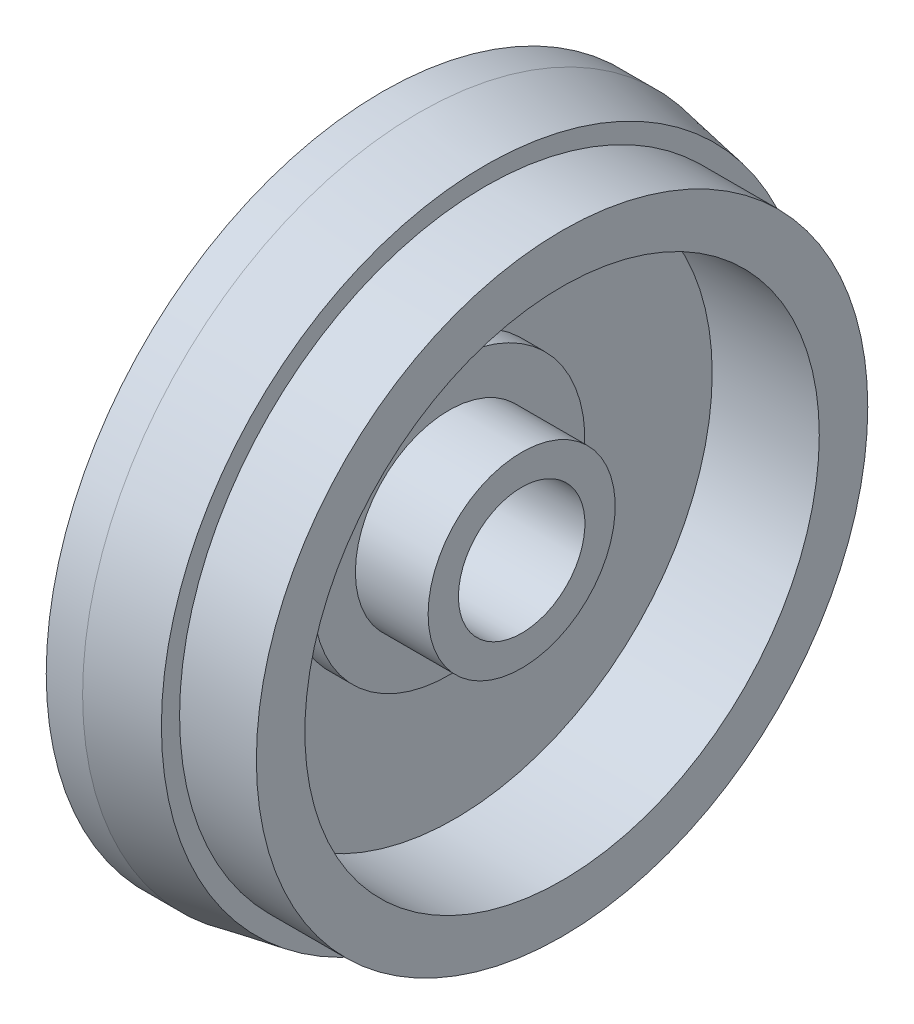
ISO-10303-21;
HEADER;
FILE_DESCRIPTION(('STEP AP214'),'2;1');
FILE_NAME('part.step','',(''),(''),'','','');
FILE_SCHEMA(('AUTOMOTIVE_DESIGN { 1 0 10303 214 1 1 1 1 }'));
ENDSEC;
DATA;
#1=APPLICATION_CONTEXT('core data for automotive mechanical design processes');
#2=APPLICATION_PROTOCOL_DEFINITION('international standard','automotive_design',2000,#1);
#3=PRODUCT_CONTEXT('',#1,'mechanical');
#4=PRODUCT('Part','Part','',(#3));
#5=PRODUCT_RELATED_PRODUCT_CATEGORY('part','',(#4));
#6=PRODUCT_DEFINITION_FORMATION('','',#4);
#7=PRODUCT_DEFINITION_CONTEXT('part definition',#1,'design');
#8=PRODUCT_DEFINITION('design','',#6,#7);
#9=PRODUCT_DEFINITION_SHAPE('','',#8);
#10=(LENGTH_UNIT() NAMED_UNIT(*) SI_UNIT(.MILLI.,.METRE.));
#11=(NAMED_UNIT(*) PLANE_ANGLE_UNIT() SI_UNIT($,.RADIAN.));
#12=(NAMED_UNIT(*) SI_UNIT($,.STERADIAN.) SOLID_ANGLE_UNIT());
#13=UNCERTAINTY_MEASURE_WITH_UNIT(LENGTH_MEASURE(1.E-05),#10,'distance_accuracy_value','');
#14=(GEOMETRIC_REPRESENTATION_CONTEXT(3) GLOBAL_UNCERTAINTY_ASSIGNED_CONTEXT((#13)) GLOBAL_UNIT_ASSIGNED_CONTEXT((#10,
#11,#12)) REPRESENTATION_CONTEXT('',''));
#15=CARTESIAN_POINT('',(0.,0.,0.));
#16=DIRECTION('',(0.,0.,1.));
#17=DIRECTION('',(1.,0.,0.));
#18=AXIS2_PLACEMENT_3D('',#15,#16,#17);
#19=CARTESIAN_POINT('',(535.225183996548,157.5,0.));
#20=DIRECTION('',(-1.,0.,0.));
#21=DIRECTION('',(0.,0.,1.));
#22=AXIS2_PLACEMENT_3D('',#19,#20,#21);
#23=CYLINDRICAL_SURFACE('',#22,22.432228314565);
#24=CARTESIAN_POINT('',(537.225183996548,157.5,0.));
#25=DIRECTION('',(-1.,0.,0.));
#26=DIRECTION('',(0.,0.,1.));
#27=AXIS2_PLACEMENT_3D('',#24,#25,#26);
#28=CIRCLE('',#27,22.432228314565);
#29=CARTESIAN_POINT('',(537.225183996548,157.5,22.432228314565));
#30=VERTEX_POINT('',#29);
#31=EDGE_CURVE('E18',#30,#30,#28,.T.);
#32=ORIENTED_EDGE('',*,*,#31,.T.);
#33=EDGE_LOOP('',(#32));
#34=FACE_BOUND('',#33,.T.);
#35=CARTESIAN_POINT('',(533.225183996548,157.5,0.));
#36=DIRECTION('',(-1.,0.,0.));
#37=DIRECTION('',(0.,0.,1.));
#38=AXIS2_PLACEMENT_3D('',#35,#36,#37);
#39=CIRCLE('',#38,22.432228314565);
#40=CARTESIAN_POINT('',(533.225183996548,157.5,22.432228314565));
#41=VERTEX_POINT('',#40);
#42=EDGE_CURVE('E78',#41,#41,#39,.F.);
#43=ORIENTED_EDGE('',*,*,#42,.T.);
#44=EDGE_LOOP('',(#43));
#45=FACE_BOUND('',#44,.T.);
#46=ADVANCED_FACE('F15',(#34,#45),#23,.T.);
#47=CARTESIAN_POINT('',(537.225183996548,176.432228314565,0.));
#48=DIRECTION('',(-1.,0.,0.));
#49=DIRECTION('',(0.,0.,1.));
#50=AXIS2_PLACEMENT_3D('',#47,#48,#49);
#51=PLANE('',#50);
#52=CARTESIAN_POINT('',(537.225183996548,157.5,0.));
#53=DIRECTION('',(-1.,0.,0.));
#54=DIRECTION('',(0.,0.,1.));
#55=AXIS2_PLACEMENT_3D('',#52,#53,#54);
#56=CIRCLE('',#55,15.432228314565);
#57=CARTESIAN_POINT('',(537.225183996548,157.5,15.432228314565));
#58=VERTEX_POINT('',#57);
#59=EDGE_CURVE('E76',#58,#58,#56,.F.);
#60=ORIENTED_EDGE('',*,*,#59,.F.);
#61=EDGE_LOOP('',(#60));
#62=FACE_BOUND('',#61,.T.);
#63=ORIENTED_EDGE('',*,*,#31,.F.);
#64=EDGE_LOOP('',(#63));
#65=FACE_BOUND('',#64,.T.);
#66=ADVANCED_FACE('F86',(#62,#65),#51,.F.);
#67=CARTESIAN_POINT('',(533.225183996548,193.932228314565,0.));
#68=DIRECTION('',(-1.,0.,0.));
#69=DIRECTION('',(0.,0.,1.));
#70=AXIS2_PLACEMENT_3D('',#67,#68,#69);
#71=PLANE('',#70);
#72=ORIENTED_EDGE('',*,*,#42,.F.);
#73=EDGE_LOOP('',(#72));
#74=FACE_BOUND('',#73,.T.);
#75=CARTESIAN_POINT('',(533.225183996548,157.5,0.));
#76=DIRECTION('',(-1.,0.,0.));
#77=DIRECTION('',(0.,0.,1.));
#78=AXIS2_PLACEMENT_3D('',#75,#76,#77);
#79=CIRCLE('',#78,50.432228314565);
#80=CARTESIAN_POINT('',(533.225183996548,157.5,50.432228314565));
#81=VERTEX_POINT('',#80);
#82=EDGE_CURVE('E73',#81,#81,#79,.F.);
#83=ORIENTED_EDGE('',*,*,#82,.T.);
#84=EDGE_LOOP('',(#83));
#85=FACE_BOUND('',#84,.T.);
#86=ADVANCED_FACE('F88',(#74,#85),#71,.F.);
#87=CARTESIAN_POINT('',(543.225183996548,157.5,0.));
#88=DIRECTION('',(-1.,0.,0.));
#89=DIRECTION('',(0.,0.,1.));
#90=AXIS2_PLACEMENT_3D('',#87,#88,#89);
#91=CYLINDRICAL_SURFACE('',#90,15.432228314565);
#92=CARTESIAN_POINT('',(549.225183996548,157.5,0.));
#93=DIRECTION('',(-1.,0.,0.));
#94=DIRECTION('',(0.,0.,1.));
#95=AXIS2_PLACEMENT_3D('',#92,#93,#94);
#96=CIRCLE('',#95,15.432228314565);
#97=CARTESIAN_POINT('',(549.225183996548,157.5,15.432228314565));
#98=VERTEX_POINT('',#97);
#99=EDGE_CURVE('E70',#98,#98,#96,.T.);
#100=ORIENTED_EDGE('',*,*,#99,.T.);
#101=EDGE_LOOP('',(#100));
#102=FACE_BOUND('',#101,.T.);
#103=ORIENTED_EDGE('',*,*,#59,.T.);
#104=EDGE_LOOP('',(#103));
#105=FACE_BOUND('',#104,.T.);
#106=ADVANCED_FACE('F95',(#102,#105),#91,.T.);
#107=CARTESIAN_POINT('',(535.725183996548,157.5,0.));
#108=DIRECTION('',(-1.,0.,0.));
#109=DIRECTION('',(0.,0.,1.));
#110=AXIS2_PLACEMENT_3D('',#107,#108,#109);
#111=CYLINDRICAL_SURFACE('',#110,50.432228314565);
#112=ORIENTED_EDGE('',*,*,#82,.F.);
#113=EDGE_LOOP('',(#112));
#114=FACE_BOUND('',#113,.T.);
#115=CARTESIAN_POINT('',(538.225183996548,157.5,0.));
#116=DIRECTION('',(-1.,0.,0.));
#117=DIRECTION('',(0.,0.,1.));
#118=AXIS2_PLACEMENT_3D('',#115,#116,#117);
#119=CIRCLE('',#118,50.432228314565);
#120=CARTESIAN_POINT('',(538.225183996548,157.5,50.432228314565));
#121=VERTEX_POINT('',#120);
#122=EDGE_CURVE('E67',#121,#121,#119,.F.);
#123=ORIENTED_EDGE('',*,*,#122,.T.);
#124=EDGE_LOOP('',(#123));
#125=FACE_BOUND('',#124,.T.);
#126=ADVANCED_FACE('F165',(#114,#125),#111,.F.);
#127=CARTESIAN_POINT('',(549.225183996548,170.432228314565,0.));
#128=DIRECTION('',(-1.,0.,0.));
#129=DIRECTION('',(0.,0.,1.));
#130=AXIS2_PLACEMENT_3D('',#127,#128,#129);
#131=PLANE('',#130);
#132=CARTESIAN_POINT('',(549.225183996548,157.5,0.));
#133=DIRECTION('',(-1.,0.,0.));
#134=DIRECTION('',(0.,0.,1.));
#135=AXIS2_PLACEMENT_3D('',#132,#133,#134);
#136=CIRCLE('',#135,10.432228314565);
#137=CARTESIAN_POINT('',(549.225183996548,157.5,10.432228314565));
#138=VERTEX_POINT('',#137);
#139=EDGE_CURVE('E64',#138,#138,#136,.T.);
#140=ORIENTED_EDGE('',*,*,#139,.T.);
#141=EDGE_LOOP('',(#140));
#142=FACE_BOUND('',#141,.T.);
#143=ORIENTED_EDGE('',*,*,#99,.F.);
#144=EDGE_LOOP('',(#143));
#145=FACE_BOUND('',#144,.T.);
#146=ADVANCED_FACE('F161',(#142,#145),#131,.F.);
#147=CARTESIAN_POINT('',(538.225183996548,203.932823212759,0.));
#148=DIRECTION('',(1.,0.,0.));
#149=DIRECTION('',(0.,0.,-1.));
#150=AXIS2_PLACEMENT_3D('',#147,#148,#149);
#151=PLANE('',#150);
#152=ORIENTED_EDGE('',*,*,#122,.F.);
#153=EDGE_LOOP('',(#152));
#154=FACE_BOUND('',#153,.T.);
#155=CARTESIAN_POINT('',(538.225183996548,157.5,0.));
#156=DIRECTION('',(1.,0.,0.));
#157=DIRECTION('',(0.,0.,-1.));
#158=AXIS2_PLACEMENT_3D('',#155,#156,#157);
#159=CIRCLE('',#158,42.433418110953);
#160=CARTESIAN_POINT('',(538.225183996548,157.5,-42.433418110953));
#161=VERTEX_POINT('',#160);
#162=EDGE_CURVE('E61',#161,#161,#159,.T.);
#163=ORIENTED_EDGE('',*,*,#162,.T.);
#164=EDGE_LOOP('',(#163));
#165=FACE_BOUND('',#164,.T.);
#166=ADVANCED_FACE('F157',(#154,#165),#151,.F.);
#167=CARTESIAN_POINT('',(541.725183996548,157.5,0.));
#168=DIRECTION('',(-1.,0.,0.));
#169=DIRECTION('',(0.,0.,1.));
#170=AXIS2_PLACEMENT_3D('',#167,#168,#169);
#171=CYLINDRICAL_SURFACE('',#170,10.432228314565);
#172=CARTESIAN_POINT('',(534.225183996548,157.5,0.));
#173=DIRECTION('',(-1.,0.,0.));
#174=DIRECTION('',(0.,0.,1.));
#175=AXIS2_PLACEMENT_3D('',#172,#173,#174);
#176=CIRCLE('',#175,10.432228314565);
#177=CARTESIAN_POINT('',(534.225183996548,157.5,10.432228314565));
#178=VERTEX_POINT('',#177);
#179=EDGE_CURVE('E58',#178,#178,#176,.T.);
#180=ORIENTED_EDGE('',*,*,#179,.T.);
#181=EDGE_LOOP('',(#180));
#182=FACE_BOUND('',#181,.T.);
#183=ORIENTED_EDGE('',*,*,#139,.F.);
#184=EDGE_LOOP('',(#183));
#185=FACE_BOUND('',#184,.T.);
#186=ADVANCED_FACE('F153',(#182,#185),#171,.F.);
#187=CARTESIAN_POINT('',(547.058284718157,157.5,0.));
#188=DIRECTION('',(1.,0.,0.));
#189=DIRECTION('',(0.,0.,-1.));
#190=AXIS2_PLACEMENT_3D('',#187,#188,#189);
#191=CYLINDRICAL_SURFACE('',#190,42.433418110953);
#192=ORIENTED_EDGE('',*,*,#162,.F.);
#193=EDGE_LOOP('',(#192));
#194=FACE_BOUND('',#193,.T.);
#195=CARTESIAN_POINT('',(555.891385439765,157.5,0.));
#196=DIRECTION('',(1.,0.,0.));
#197=DIRECTION('',(0.,0.,-1.));
#198=AXIS2_PLACEMENT_3D('',#195,#196,#197);
#199=CIRCLE('',#198,42.433418110953);
#200=CARTESIAN_POINT('',(555.891385439765,157.5,-42.433418110953));
#201=VERTEX_POINT('',#200);
#202=EDGE_CURVE('E55',#201,#201,#199,.F.);
#203=ORIENTED_EDGE('',*,*,#202,.F.);
#204=EDGE_LOOP('',(#203));
#205=FACE_BOUND('',#204,.T.);
#206=ADVANCED_FACE('F149',(#194,#205),#191,.F.);
#207=CARTESIAN_POINT('',(534.225183996548,164.432228314565,0.));
#208=DIRECTION('',(-1.,0.,0.));
#209=DIRECTION('',(0.,0.,1.));
#210=AXIS2_PLACEMENT_3D('',#207,#208,#209);
#211=PLANE('',#210);
#212=ORIENTED_EDGE('',*,*,#179,.F.);
#213=EDGE_LOOP('',(#212));
#214=FACE_BOUND('',#213,.T.);
#215=CARTESIAN_POINT('',(534.225183996548,157.5,0.));
#216=DIRECTION('',(-1.,0.,0.));
#217=DIRECTION('',(0.,0.,1.));
#218=AXIS2_PLACEMENT_3D('',#215,#216,#217);
#219=CIRCLE('',#218,3.43222831456501);
#220=CARTESIAN_POINT('',(534.225183996548,157.5,3.43222831456501));
#221=VERTEX_POINT('',#220);
#222=EDGE_CURVE('E52',#221,#221,#219,.T.);
#223=ORIENTED_EDGE('',*,*,#222,.T.);
#224=EDGE_LOOP('',(#223));
#225=FACE_BOUND('',#224,.T.);
#226=ADVANCED_FACE('F145',(#214,#225),#211,.F.);
#227=CARTESIAN_POINT('',(555.891385439765,203.932823212759,0.));
#228=DIRECTION('',(1.,0.,0.));
#229=DIRECTION('',(0.,0.,-1.));
#230=AXIS2_PLACEMENT_3D('',#227,#228,#229);
#231=PLANE('',#230);
#232=ORIENTED_EDGE('',*,*,#202,.T.);
#233=EDGE_LOOP('',(#232));
#234=FACE_BOUND('',#233,.T.);
#235=CARTESIAN_POINT('',(555.891385439765,157.5,0.));
#236=DIRECTION('',(1.,0.,0.));
#237=DIRECTION('',(0.,0.,-1.));
#238=AXIS2_PLACEMENT_3D('',#235,#236,#237);
#239=CIRCLE('',#238,50.432228314565);
#240=CARTESIAN_POINT('',(555.891385439765,157.5,-50.432228314565));
#241=VERTEX_POINT('',#240);
#242=EDGE_CURVE('E49',#241,#241,#239,.F.);
#243=ORIENTED_EDGE('',*,*,#242,.F.);
#244=EDGE_LOOP('',(#243));
#245=FACE_BOUND('',#244,.T.);
#246=ADVANCED_FACE('F141',(#234,#245),#231,.T.);
#247=CARTESIAN_POINT('',(529.225183996548,157.5,0.));
#248=DIRECTION('',(-1.,0.,0.));
#249=DIRECTION('',(0.,0.,1.));
#250=AXIS2_PLACEMENT_3D('',#247,#248,#249);
#251=CYLINDRICAL_SURFACE('',#250,3.43222831456501);
#252=CARTESIAN_POINT('',(526.225183996548,157.5,0.));
#253=DIRECTION('',(-1.,0.,0.));
#254=DIRECTION('',(0.,0.,1.));
#255=AXIS2_PLACEMENT_3D('',#252,#253,#254);
#256=CIRCLE('',#255,3.43222831456501);
#257=CARTESIAN_POINT('',(526.225183996548,157.5,3.43222831456501));
#258=VERTEX_POINT('',#257);
#259=EDGE_CURVE('E46',#258,#258,#256,.F.);
#260=ORIENTED_EDGE('',*,*,#259,.F.);
#261=EDGE_LOOP('',(#260));
#262=FACE_BOUND('',#261,.T.);
#263=ORIENTED_EDGE('',*,*,#222,.F.);
#264=EDGE_LOOP('',(#263));
#265=FACE_BOUND('',#264,.T.);
#266=ADVANCED_FACE('F137',(#262,#265),#251,.F.);
#267=CARTESIAN_POINT('',(549.558284718157,157.5,0.));
#268=DIRECTION('',(1.,0.,0.));
#269=DIRECTION('',(0.,0.,-1.));
#270=AXIS2_PLACEMENT_3D('',#267,#268,#269);
#271=CYLINDRICAL_SURFACE('',#270,50.432228314565);
#272=ORIENTED_EDGE('',*,*,#242,.T.);
#273=EDGE_LOOP('',(#272));
#274=FACE_BOUND('',#273,.T.);
#275=CARTESIAN_POINT('',(543.225183996548,157.5,0.));
#276=DIRECTION('',(1.,0.,0.));
#277=DIRECTION('',(0.,0.,-1.));
#278=AXIS2_PLACEMENT_3D('',#275,#276,#277);
#279=CIRCLE('',#278,50.432228314565);
#280=CARTESIAN_POINT('',(543.225183996548,157.5,-50.432228314565));
#281=VERTEX_POINT('',#280);
#282=EDGE_CURVE('E43',#281,#281,#279,.T.);
#283=ORIENTED_EDGE('',*,*,#282,.T.);
#284=EDGE_LOOP('',(#283));
#285=FACE_BOUND('',#284,.T.);
#286=ADVANCED_FACE('F133',(#274,#285),#271,.T.);
#287=CARTESIAN_POINT('',(526.225183996548,234.932228314565,0.));
#288=DIRECTION('',(-1.,0.,0.));
#289=DIRECTION('',(0.,0.,1.));
#290=AXIS2_PLACEMENT_3D('',#287,#288,#289);
#291=PLANE('',#290);
#292=ORIENTED_EDGE('',*,*,#259,.T.);
#293=EDGE_LOOP('',(#292));
#294=FACE_BOUND('',#293,.T.);
#295=CARTESIAN_POINT('',(526.225183996548,157.5,0.));
#296=DIRECTION('',(-1.,0.,0.));
#297=DIRECTION('',(0.,0.,1.));
#298=AXIS2_PLACEMENT_3D('',#295,#296,#297);
#299=CIRCLE('',#298,10.432228314565);
#300=CARTESIAN_POINT('',(526.225183996548,157.5,10.432228314565));
#301=VERTEX_POINT('',#300);
#302=EDGE_CURVE('E40',#301,#301,#299,.T.);
#303=ORIENTED_EDGE('',*,*,#302,.T.);
#304=EDGE_LOOP('',(#303));
#305=FACE_BOUND('',#304,.T.);
#306=ADVANCED_FACE('F129',(#294,#305),#291,.T.);
#307=CARTESIAN_POINT('',(543.225183996548,209.432228314565,0.));
#308=DIRECTION('',(-1.,0.,0.));
#309=DIRECTION('',(0.,0.,1.));
#310=AXIS2_PLACEMENT_3D('',#307,#308,#309);
#311=PLANE('',#310);
#312=ORIENTED_EDGE('',*,*,#282,.F.);
#313=EDGE_LOOP('',(#312));
#314=FACE_BOUND('',#313,.T.);
#315=CARTESIAN_POINT('',(543.225183996548,157.5,0.));
#316=DIRECTION('',(-1.,0.,0.));
#317=DIRECTION('',(0.,0.,1.));
#318=AXIS2_PLACEMENT_3D('',#315,#316,#317);
#319=CIRCLE('',#318,53.432228314565);
#320=CARTESIAN_POINT('',(543.225183996548,157.5,53.432228314565));
#321=VERTEX_POINT('',#320);
#322=EDGE_CURVE('E37',#321,#321,#319,.T.);
#323=ORIENTED_EDGE('',*,*,#322,.F.);
#324=EDGE_LOOP('',(#323));
#325=FACE_BOUND('',#324,.T.);
#326=ADVANCED_FACE('F125',(#314,#325),#311,.F.);
#327=CARTESIAN_POINT('',(518.725183996548,157.5,0.));
#328=DIRECTION('',(-1.,0.,0.));
#329=DIRECTION('',(0.,0.,1.));
#330=AXIS2_PLACEMENT_3D('',#327,#328,#329);
#331=CYLINDRICAL_SURFACE('',#330,10.432228314565);
#332=CARTESIAN_POINT('',(515.225183996548,157.5,0.));
#333=DIRECTION('',(-1.,0.,0.));
#334=DIRECTION('',(0.,0.,1.));
#335=AXIS2_PLACEMENT_3D('',#332,#333,#334);
#336=CIRCLE('',#335,10.432228314565);
#337=CARTESIAN_POINT('',(515.225183996548,157.5,10.432228314565));
#338=VERTEX_POINT('',#337);
#339=EDGE_CURVE('E34',#338,#338,#336,.T.);
#340=ORIENTED_EDGE('',*,*,#339,.T.);
#341=EDGE_LOOP('',(#340));
#342=FACE_BOUND('',#341,.T.);
#343=ORIENTED_EDGE('',*,*,#302,.F.);
#344=EDGE_LOOP('',(#343));
#345=FACE_BOUND('',#344,.T.);
#346=ADVANCED_FACE('F121',(#342,#345),#331,.F.);
#347=CARTESIAN_POINT('',(532.225183996548,157.5,0.));
#348=DIRECTION('',(-1.,0.,0.));
#349=DIRECTION('',(0.,0.,1.));
#350=AXIS2_PLACEMENT_3D('',#347,#348,#349);
#351=CONICAL_SURFACE('',#350,55.432228314565,0.179853499792478);
#352=ORIENTED_EDGE('',*,*,#322,.T.);
#353=EDGE_LOOP('',(#352));
#354=FACE_BOUND('',#353,.T.);
#355=CARTESIAN_POINT('',(532.225183996548,157.5,0.));
#356=DIRECTION('',(1.,0.,0.));
#357=DIRECTION('',(0.,0.,-1.));
#358=AXIS2_PLACEMENT_3D('',#355,#356,#357);
#359=CIRCLE('',#358,55.432228314565);
#360=CARTESIAN_POINT('',(532.225183996548,157.5,-55.432228314565));
#361=VERTEX_POINT('',#360);
#362=EDGE_CURVE('E30',#361,#361,#359,.F.);
#363=ORIENTED_EDGE('',*,*,#362,.F.);
#364=EDGE_LOOP('',(#363));
#365=FACE_BOUND('',#364,.T.);
#366=ADVANCED_FACE('F117',(#354,#365),#351,.T.);
#367=CARTESIAN_POINT('',(515.225183996548,203.932823212759,0.));
#368=DIRECTION('',(1.,0.,0.));
#369=DIRECTION('',(0.,0.,-1.));
#370=AXIS2_PLACEMENT_3D('',#367,#368,#369);
#371=PLANE('',#370);
#372=ORIENTED_EDGE('',*,*,#339,.F.);
#373=EDGE_LOOP('',(#372));
#374=FACE_BOUND('',#373,.T.);
#375=CARTESIAN_POINT('',(515.225183996548,157.5,0.));
#376=DIRECTION('',(-1.,0.,0.));
#377=DIRECTION('',(0.,0.,1.));
#378=AXIS2_PLACEMENT_3D('',#375,#376,#377);
#379=CIRCLE('',#378,15.432228314565);
#380=CARTESIAN_POINT('',(515.225183996548,157.5,15.432228314565));
#381=VERTEX_POINT('',#380);
#382=EDGE_CURVE('E27',#381,#381,#379,.F.);
#383=ORIENTED_EDGE('',*,*,#382,.F.);
#384=EDGE_LOOP('',(#383));
#385=FACE_BOUND('',#384,.T.);
#386=ADVANCED_FACE('F113',(#374,#385),#371,.F.);
#387=CARTESIAN_POINT('',(522.925159996548,157.5,0.));
#388=DIRECTION('',(1.,0.,0.));
#389=DIRECTION('',(0.,0.,-1.));
#390=AXIS2_PLACEMENT_3D('',#387,#388,#389);
#391=CYLINDRICAL_SURFACE('',#390,55.432228314565);
#392=CARTESIAN_POINT('',(526.225183996548,157.5,0.));
#393=DIRECTION('',(1.,0.,0.));
#394=DIRECTION('',(0.,0.,-1.));
#395=AXIS2_PLACEMENT_3D('',#392,#393,#394);
#396=CIRCLE('',#395,55.432228314565);
#397=CARTESIAN_POINT('',(526.225183996548,157.5,-55.432228314565));
#398=VERTEX_POINT('',#397);
#399=EDGE_CURVE('E22',#398,#398,#396,.F.);
#400=ORIENTED_EDGE('',*,*,#399,.F.);
#401=EDGE_LOOP('',(#400));
#402=FACE_BOUND('',#401,.T.);
#403=ORIENTED_EDGE('',*,*,#362,.T.);
#404=EDGE_LOOP('',(#403));
#405=FACE_BOUND('',#404,.T.);
#406=ADVANCED_FACE('F106',(#402,#405),#391,.T.);
#407=CARTESIAN_POINT('',(520.225183996548,157.5,0.));
#408=DIRECTION('',(-1.,0.,0.));
#409=DIRECTION('',(0.,0.,1.));
#410=AXIS2_PLACEMENT_3D('',#407,#408,#409);
#411=CYLINDRICAL_SURFACE('',#410,15.432228314565);
#412=CARTESIAN_POINT('',(526.225183996548,157.5,0.));
#413=DIRECTION('',(-1.,0.,0.));
#414=DIRECTION('',(0.,0.,1.));
#415=AXIS2_PLACEMENT_3D('',#412,#413,#414);
#416=CIRCLE('',#415,15.432228314565);
#417=CARTESIAN_POINT('',(526.225183996548,157.5,15.432228314565));
#418=VERTEX_POINT('',#417);
#419=EDGE_CURVE('E10',#418,#418,#416,.F.);
#420=ORIENTED_EDGE('',*,*,#419,.F.);
#421=EDGE_LOOP('',(#420));
#422=FACE_BOUND('',#421,.T.);
#423=ORIENTED_EDGE('',*,*,#382,.T.);
#424=EDGE_LOOP('',(#423));
#425=FACE_BOUND('',#424,.T.);
#426=ADVANCED_FACE('F101',(#422,#425),#411,.T.);
#427=CARTESIAN_POINT('',(526.225183996548,234.932228314565,0.));
#428=DIRECTION('',(-1.,0.,0.));
#429=DIRECTION('',(0.,0.,1.));
#430=AXIS2_PLACEMENT_3D('',#427,#428,#429);
#431=PLANE('',#430);
#432=ORIENTED_EDGE('',*,*,#419,.T.);
#433=EDGE_LOOP('',(#432));
#434=FACE_BOUND('',#433,.T.);
#435=ORIENTED_EDGE('',*,*,#399,.T.);
#436=EDGE_LOOP('',(#435));
#437=FACE_BOUND('',#436,.T.);
#438=ADVANCED_FACE('F99',(#434,#437),#431,.T.);
#439=CLOSED_SHELL('',(#46,#66,#86,#106,#126,#146,#166,#186,#206,#226,#246,#266,#286,#306,#326,
#346,#366,#386,#406,#426,#438));
#440=MANIFOLD_SOLID_BREP('B1',#439);
#441=ADVANCED_BREP_SHAPE_REPRESENTATION('',(#18,#440),#14);
#442=SHAPE_DEFINITION_REPRESENTATION(#9,#441);
ENDSEC;
END-ISO-10303-21;
